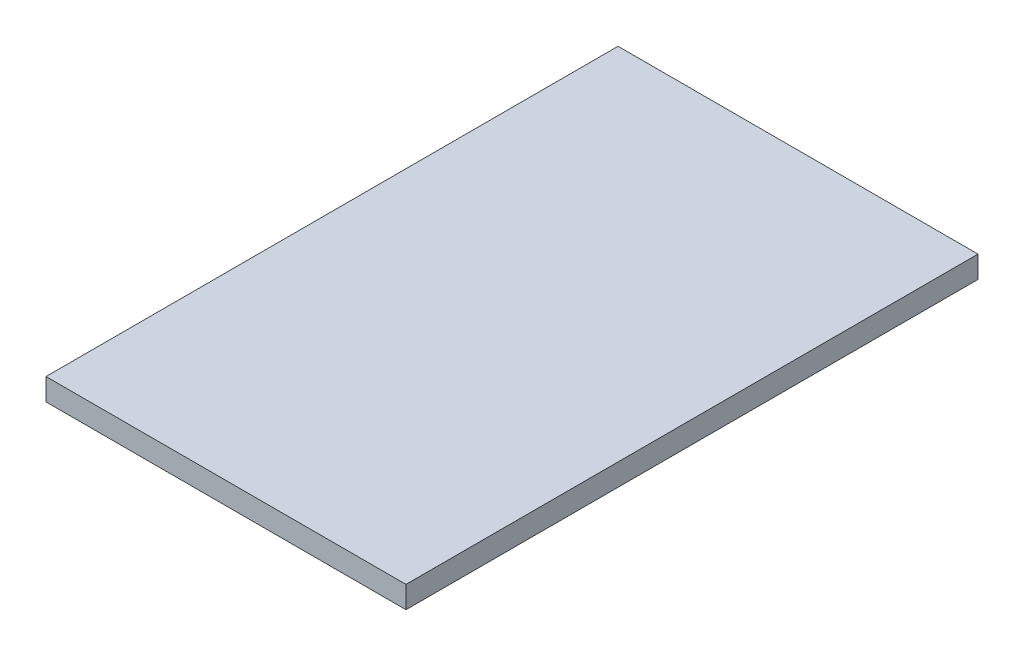
ISO-10303-21;
HEADER;
FILE_DESCRIPTION(('STEP AP214'),'2;1');
FILE_NAME('part.step','',(''),(''),'','','');
FILE_SCHEMA(('AUTOMOTIVE_DESIGN { 1 0 10303 214 1 1 1 1 }'));
ENDSEC;
DATA;
#1=APPLICATION_CONTEXT('core data for automotive mechanical design processes');
#2=APPLICATION_PROTOCOL_DEFINITION('international standard','automotive_design',2000,#1);
#3=PRODUCT_CONTEXT('',#1,'mechanical');
#4=PRODUCT('Part','Part','',(#3));
#5=PRODUCT_RELATED_PRODUCT_CATEGORY('part','',(#4));
#6=PRODUCT_DEFINITION_FORMATION('','',#4);
#7=PRODUCT_DEFINITION_CONTEXT('part definition',#1,'design');
#8=PRODUCT_DEFINITION('design','',#6,#7);
#9=PRODUCT_DEFINITION_SHAPE('','',#8);
#10=(LENGTH_UNIT() NAMED_UNIT(*) SI_UNIT(.MILLI.,.METRE.));
#11=(NAMED_UNIT(*) PLANE_ANGLE_UNIT() SI_UNIT($,.RADIAN.));
#12=(NAMED_UNIT(*) SI_UNIT($,.STERADIAN.) SOLID_ANGLE_UNIT());
#13=UNCERTAINTY_MEASURE_WITH_UNIT(LENGTH_MEASURE(1.E-05),#10,'distance_accuracy_value','');
#14=(GEOMETRIC_REPRESENTATION_CONTEXT(3) GLOBAL_UNCERTAINTY_ASSIGNED_CONTEXT((#13)) GLOBAL_UNIT_ASSIGNED_CONTEXT((#10,
#11,#12)) REPRESENTATION_CONTEXT('',''));
#15=CARTESIAN_POINT('',(0.,0.,0.));
#16=DIRECTION('',(0.,0.,1.));
#17=DIRECTION('',(1.,0.,0.));
#18=AXIS2_PLACEMENT_3D('',#15,#16,#17);
#19=CARTESIAN_POINT('',(0.,1.6002,0.));
#20=DIRECTION('',(1.,0.,0.));
#21=DIRECTION('',(0.,0.,-1.));
#22=AXIS2_PLACEMENT_3D('',#19,#20,#21);
#23=PLANE('',#22);
#24=DIRECTION('',(0.,0.,1.));
#25=VECTOR('',#24,1.);
#26=CARTESIAN_POINT('',(0.,0.,0.));
#27=LINE('',#26,#25);
#28=CARTESIAN_POINT('',(0.,0.,-41.656));
#29=VERTEX_POINT('',#28);
#30=CARTESIAN_POINT('',(0.,0.,0.));
#31=VERTEX_POINT('',#30);
#32=EDGE_CURVE('E96',#29,#31,#27,.T.);
#33=ORIENTED_EDGE('',*,*,#32,.T.);
#34=DIRECTION('',(0.,-1.,0.));
#35=VECTOR('',#34,1.);
#36=CARTESIAN_POINT('',(0.,1.6002,0.));
#37=LINE('',#36,#35);
#38=CARTESIAN_POINT('',(0.,1.6002,0.));
#39=VERTEX_POINT('',#38);
#40=EDGE_CURVE('E11',#39,#31,#37,.T.);
#41=ORIENTED_EDGE('',*,*,#40,.F.);
#42=DIRECTION('',(0.,0.,1.));
#43=VECTOR('',#42,1.);
#44=CARTESIAN_POINT('',(0.,1.6002,0.));
#45=LINE('',#44,#43);
#46=CARTESIAN_POINT('',(0.,1.6002,-41.656));
#47=VERTEX_POINT('',#46);
#48=EDGE_CURVE('E84',#47,#39,#45,.T.);
#49=ORIENTED_EDGE('',*,*,#48,.F.);
#50=DIRECTION('',(0.,-1.,0.));
#51=VECTOR('',#50,1.);
#52=CARTESIAN_POINT('',(0.,1.6002,-41.656));
#53=LINE('',#52,#51);
#54=EDGE_CURVE('E92',#47,#29,#53,.T.);
#55=ORIENTED_EDGE('',*,*,#54,.T.);
#56=EDGE_LOOP('',(#33,#41,#49,#55));
#57=FACE_BOUND('',#56,.T.);
#58=ADVANCED_FACE('F33',(#57),#23,.F.);
#59=CARTESIAN_POINT('',(0.,1.6002,0.));
#60=DIRECTION('',(0.,0.,-1.));
#61=DIRECTION('',(-1.,0.,0.));
#62=AXIS2_PLACEMENT_3D('',#59,#60,#61);
#63=PLANE('',#62);
#64=DIRECTION('',(1.,0.,0.));
#65=VECTOR('',#64,1.);
#66=CARTESIAN_POINT('',(0.,0.,0.));
#67=LINE('',#66,#65);
#68=CARTESIAN_POINT('',(26.2128,0.,0.));
#69=VERTEX_POINT('',#68);
#70=EDGE_CURVE('E88',#31,#69,#67,.T.);
#71=ORIENTED_EDGE('',*,*,#70,.T.);
#72=DIRECTION('',(0.,-1.,0.));
#73=VECTOR('',#72,1.);
#74=CARTESIAN_POINT('',(26.2128,1.6002,0.));
#75=LINE('',#74,#73);
#76=CARTESIAN_POINT('',(26.2128,1.6002,0.));
#77=VERTEX_POINT('',#76);
#78=EDGE_CURVE('E41',#77,#69,#75,.T.);
#79=ORIENTED_EDGE('',*,*,#78,.F.);
#80=DIRECTION('',(1.,0.,0.));
#81=VECTOR('',#80,1.);
#82=CARTESIAN_POINT('',(0.,1.6002,0.));
#83=LINE('',#82,#81);
#84=EDGE_CURVE('E79',#39,#77,#83,.T.);
#85=ORIENTED_EDGE('',*,*,#84,.F.);
#86=ORIENTED_EDGE('',*,*,#40,.T.);
#87=EDGE_LOOP('',(#71,#79,#85,#86));
#88=FACE_BOUND('',#87,.T.);
#89=ADVANCED_FACE('F87',(#88),#63,.F.);
#90=CARTESIAN_POINT('',(26.2128,1.6002,0.));
#91=DIRECTION('',(-1.,0.,0.));
#92=DIRECTION('',(0.,0.,1.));
#93=AXIS2_PLACEMENT_3D('',#90,#91,#92);
#94=PLANE('',#93);
#95=DIRECTION('',(0.,0.,-1.));
#96=VECTOR('',#95,1.);
#97=CARTESIAN_POINT('',(26.2128,0.,0.));
#98=LINE('',#97,#96);
#99=CARTESIAN_POINT('',(26.2128,0.,-41.656));
#100=VERTEX_POINT('',#99);
#101=EDGE_CURVE('E66',#69,#100,#98,.T.);
#102=ORIENTED_EDGE('',*,*,#101,.T.);
#103=DIRECTION('',(0.,-1.,0.));
#104=VECTOR('',#103,1.);
#105=CARTESIAN_POINT('',(26.2128,1.6002,-41.656));
#106=LINE('',#105,#104);
#107=CARTESIAN_POINT('',(26.2128,1.6002,-41.656));
#108=VERTEX_POINT('',#107);
#109=EDGE_CURVE('E89',#108,#100,#106,.T.);
#110=ORIENTED_EDGE('',*,*,#109,.F.);
#111=DIRECTION('',(0.,0.,-1.));
#112=VECTOR('',#111,1.);
#113=CARTESIAN_POINT('',(26.2128,1.6002,0.));
#114=LINE('',#113,#112);
#115=EDGE_CURVE('E82',#77,#108,#114,.T.);
#116=ORIENTED_EDGE('',*,*,#115,.F.);
#117=ORIENTED_EDGE('',*,*,#78,.T.);
#118=EDGE_LOOP('',(#102,#110,#116,#117));
#119=FACE_BOUND('',#118,.T.);
#120=ADVANCED_FACE('F90',(#119),#94,.F.);
#121=CARTESIAN_POINT('',(0.,1.6002,-41.656));
#122=DIRECTION('',(0.,0.,1.));
#123=DIRECTION('',(1.,0.,0.));
#124=AXIS2_PLACEMENT_3D('',#121,#122,#123);
#125=PLANE('',#124);
#126=DIRECTION('',(-1.,0.,0.));
#127=VECTOR('',#126,1.);
#128=CARTESIAN_POINT('',(0.,0.,-41.656));
#129=LINE('',#128,#127);
#130=EDGE_CURVE('E72',#100,#29,#129,.T.);
#131=ORIENTED_EDGE('',*,*,#130,.T.);
#132=ORIENTED_EDGE('',*,*,#54,.F.);
#133=DIRECTION('',(-1.,0.,0.));
#134=VECTOR('',#133,1.);
#135=CARTESIAN_POINT('',(0.,1.6002,-41.656));
#136=LINE('',#135,#134);
#137=EDGE_CURVE('E49',#108,#47,#136,.T.);
#138=ORIENTED_EDGE('',*,*,#137,.F.);
#139=ORIENTED_EDGE('',*,*,#109,.T.);
#140=EDGE_LOOP('',(#131,#132,#138,#139));
#141=FACE_BOUND('',#140,.T.);
#142=ADVANCED_FACE('F103',(#141),#125,.F.);
#143=CARTESIAN_POINT('',(0.,1.6002,0.));
#144=DIRECTION('',(0.,-1.,0.));
#145=DIRECTION('',(0.,0.,-1.));
#146=AXIS2_PLACEMENT_3D('',#143,#144,#145);
#147=PLANE('',#146);
#148=ORIENTED_EDGE('',*,*,#48,.T.);
#149=ORIENTED_EDGE('',*,*,#84,.T.);
#150=ORIENTED_EDGE('',*,*,#115,.T.);
#151=ORIENTED_EDGE('',*,*,#137,.T.);
#152=EDGE_LOOP('',(#148,#149,#150,#151));
#153=FACE_BOUND('',#152,.T.);
#154=ADVANCED_FACE('F80',(#153),#147,.F.);
#155=CARTESIAN_POINT('',(0.,0.,0.));
#156=DIRECTION('',(0.,-1.,0.));
#157=DIRECTION('',(0.,0.,-1.));
#158=AXIS2_PLACEMENT_3D('',#155,#156,#157);
#159=PLANE('',#158);
#160=ORIENTED_EDGE('',*,*,#32,.F.);
#161=ORIENTED_EDGE('',*,*,#130,.F.);
#162=ORIENTED_EDGE('',*,*,#101,.F.);
#163=ORIENTED_EDGE('',*,*,#70,.F.);
#164=EDGE_LOOP('',(#160,#161,#162,#163));
#165=FACE_BOUND('',#164,.T.);
#166=ADVANCED_FACE('F106',(#165),#159,.T.);
#167=CLOSED_SHELL('',(#58,#89,#120,#142,#154,#166));
#168=MANIFOLD_SOLID_BREP('B2',#167);
#169=ADVANCED_BREP_SHAPE_REPRESENTATION('',(#18,#168),#14);
#170=SHAPE_DEFINITION_REPRESENTATION(#9,#169);
ENDSEC;
END-ISO-10303-21;
